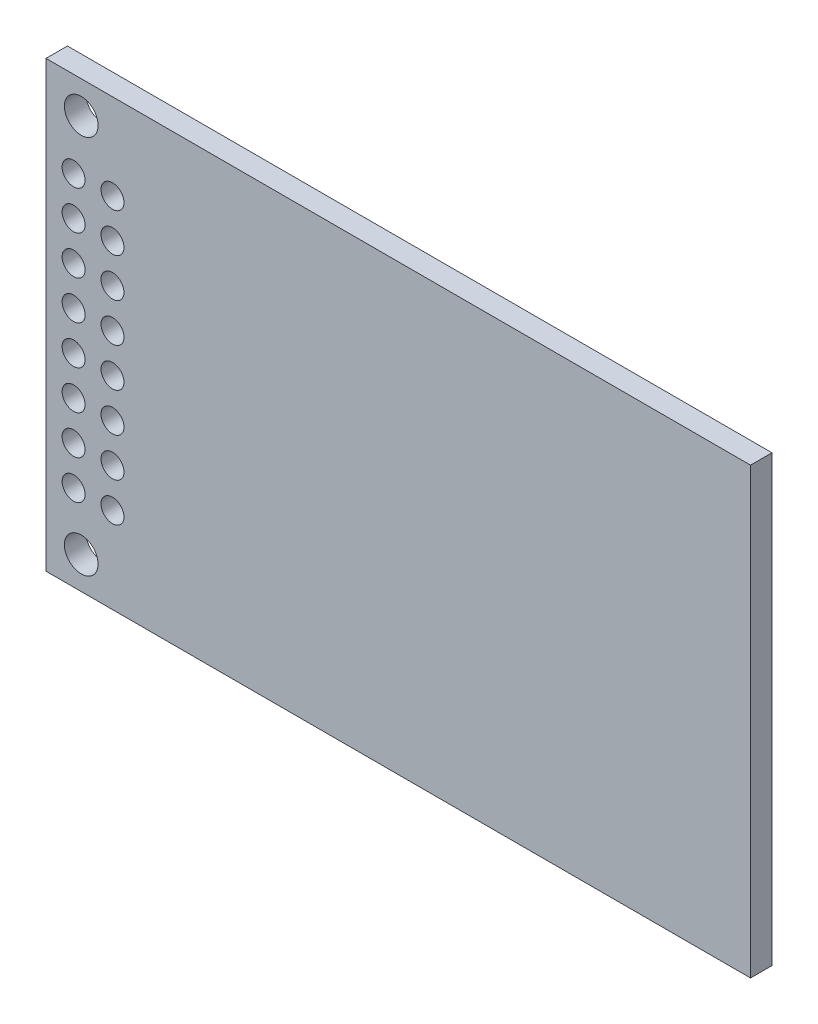
ISO-10303-21;
HEADER;
FILE_DESCRIPTION(('STEP AP214'),'2;1');
FILE_NAME('part.step','',(''),(''),'','','');
FILE_SCHEMA(('AUTOMOTIVE_DESIGN { 1 0 10303 214 1 1 1 1 }'));
ENDSEC;
DATA;
#1=APPLICATION_CONTEXT('core data for automotive mechanical design processes');
#2=APPLICATION_PROTOCOL_DEFINITION('international standard','automotive_design',2000,#1);
#3=PRODUCT_CONTEXT('',#1,'mechanical');
#4=PRODUCT('Part','Part','',(#3));
#5=PRODUCT_RELATED_PRODUCT_CATEGORY('part','',(#4));
#6=PRODUCT_DEFINITION_FORMATION('','',#4);
#7=PRODUCT_DEFINITION_CONTEXT('part definition',#1,'design');
#8=PRODUCT_DEFINITION('design','',#6,#7);
#9=PRODUCT_DEFINITION_SHAPE('','',#8);
#10=(LENGTH_UNIT() NAMED_UNIT(*) SI_UNIT(.MILLI.,.METRE.));
#11=(NAMED_UNIT(*) PLANE_ANGLE_UNIT() SI_UNIT($,.RADIAN.));
#12=(NAMED_UNIT(*) SI_UNIT($,.STERADIAN.) SOLID_ANGLE_UNIT());
#13=UNCERTAINTY_MEASURE_WITH_UNIT(LENGTH_MEASURE(1.E-05),#10,'distance_accuracy_value','');
#14=(GEOMETRIC_REPRESENTATION_CONTEXT(3) GLOBAL_UNCERTAINTY_ASSIGNED_CONTEXT((#13)) GLOBAL_UNIT_ASSIGNED_CONTEXT((#10,
#11,#12)) REPRESENTATION_CONTEXT('',''));
#15=CARTESIAN_POINT('',(0.,0.,0.));
#16=DIRECTION('',(0.,0.,1.));
#17=DIRECTION('',(1.,0.,0.));
#18=AXIS2_PLACEMENT_3D('',#15,#16,#17);
#19=CARTESIAN_POINT('',(0.,0.,0.));
#20=DIRECTION('',(0.,0.,-1.));
#21=DIRECTION('',(-1.,0.,0.));
#22=AXIS2_PLACEMENT_3D('',#19,#20,#21);
#23=PLANE('',#22);
#24=CARTESIAN_POINT('',(-20.7,12.4,0.));
#25=DIRECTION('',(0.,0.,1.));
#26=DIRECTION('',(1.,0.,0.));
#27=AXIS2_PLACEMENT_3D('',#24,#25,#26);
#28=CIRCLE('',#27,1.1);
#29=CARTESIAN_POINT('',(-19.6,12.4,0.));
#30=VERTEX_POINT('',#29);
#31=EDGE_CURVE('E131',#30,#30,#28,.T.);
#32=ORIENTED_EDGE('',*,*,#31,.T.);
#33=EDGE_LOOP('',(#32));
#34=FACE_BOUND('',#33,.T.);
#35=CARTESIAN_POINT('',(-20.7,-12.4,0.));
#36=DIRECTION('',(0.,0.,1.));
#37=DIRECTION('',(1.,0.,0.));
#38=AXIS2_PLACEMENT_3D('',#35,#36,#37);
#39=CIRCLE('',#38,1.1);
#40=CARTESIAN_POINT('',(-19.6,-12.4,0.));
#41=VERTEX_POINT('',#40);
#42=EDGE_CURVE('E134',#41,#41,#39,.T.);
#43=ORIENTED_EDGE('',*,*,#42,.T.);
#44=EDGE_LOOP('',(#43));
#45=FACE_BOUND('',#44,.T.);
#46=CARTESIAN_POINT('',(-21.2,8.89,0.));
#47=DIRECTION('',(0.,0.,1.));
#48=DIRECTION('',(1.,0.,0.));
#49=AXIS2_PLACEMENT_3D('',#46,#47,#48);
#50=CIRCLE('',#49,0.750000000000001);
#51=CARTESIAN_POINT('',(-20.45,8.89,0.));
#52=VERTEX_POINT('',#51);
#53=EDGE_CURVE('E137',#52,#52,#50,.T.);
#54=ORIENTED_EDGE('',*,*,#53,.T.);
#55=EDGE_LOOP('',(#54));
#56=FACE_BOUND('',#55,.T.);
#57=CARTESIAN_POINT('',(-18.66,8.89,0.));
#58=DIRECTION('',(0.,0.,1.));
#59=DIRECTION('',(1.,0.,0.));
#60=AXIS2_PLACEMENT_3D('',#57,#58,#59);
#61=CIRCLE('',#60,0.750000000000001);
#62=CARTESIAN_POINT('',(-17.91,8.89,0.));
#63=VERTEX_POINT('',#62);
#64=EDGE_CURVE('E140',#63,#63,#61,.T.);
#65=ORIENTED_EDGE('',*,*,#64,.T.);
#66=EDGE_LOOP('',(#65));
#67=FACE_BOUND('',#66,.T.);
#68=CARTESIAN_POINT('',(-18.66,6.35,0.));
#69=DIRECTION('',(0.,0.,1.));
#70=DIRECTION('',(1.,0.,0.));
#71=AXIS2_PLACEMENT_3D('',#68,#69,#70);
#72=CIRCLE('',#71,0.750000000000001);
#73=CARTESIAN_POINT('',(-17.91,6.35,0.));
#74=VERTEX_POINT('',#73);
#75=EDGE_CURVE('E143',#74,#74,#72,.T.);
#76=ORIENTED_EDGE('',*,*,#75,.T.);
#77=EDGE_LOOP('',(#76));
#78=FACE_BOUND('',#77,.T.);
#79=CARTESIAN_POINT('',(-18.66,3.81,0.));
#80=DIRECTION('',(0.,0.,1.));
#81=DIRECTION('',(1.,0.,0.));
#82=AXIS2_PLACEMENT_3D('',#79,#80,#81);
#83=CIRCLE('',#82,0.750000000000001);
#84=CARTESIAN_POINT('',(-17.91,3.81,0.));
#85=VERTEX_POINT('',#84);
#86=EDGE_CURVE('E146',#85,#85,#83,.T.);
#87=ORIENTED_EDGE('',*,*,#86,.T.);
#88=EDGE_LOOP('',(#87));
#89=FACE_BOUND('',#88,.T.);
#90=CARTESIAN_POINT('',(-18.66,1.27,0.));
#91=DIRECTION('',(0.,0.,1.));
#92=DIRECTION('',(1.,0.,0.));
#93=AXIS2_PLACEMENT_3D('',#90,#91,#92);
#94=CIRCLE('',#93,0.750000000000004);
#95=CARTESIAN_POINT('',(-17.91,1.27,0.));
#96=VERTEX_POINT('',#95);
#97=EDGE_CURVE('E149',#96,#96,#94,.T.);
#98=ORIENTED_EDGE('',*,*,#97,.T.);
#99=EDGE_LOOP('',(#98));
#100=FACE_BOUND('',#99,.T.);
#101=CARTESIAN_POINT('',(-18.66,-1.27,0.));
#102=DIRECTION('',(0.,0.,1.));
#103=DIRECTION('',(1.,0.,0.));
#104=AXIS2_PLACEMENT_3D('',#101,#102,#103);
#105=CIRCLE('',#104,0.750000000000001);
#106=CARTESIAN_POINT('',(-17.91,-1.27,0.));
#107=VERTEX_POINT('',#106);
#108=EDGE_CURVE('E152',#107,#107,#105,.T.);
#109=ORIENTED_EDGE('',*,*,#108,.T.);
#110=EDGE_LOOP('',(#109));
#111=FACE_BOUND('',#110,.T.);
#112=CARTESIAN_POINT('',(-18.66,-3.81,0.));
#113=DIRECTION('',(0.,0.,1.));
#114=DIRECTION('',(1.,0.,0.));
#115=AXIS2_PLACEMENT_3D('',#112,#113,#114);
#116=CIRCLE('',#115,0.750000000000001);
#117=CARTESIAN_POINT('',(-17.91,-3.81,0.));
#118=VERTEX_POINT('',#117);
#119=EDGE_CURVE('E155',#118,#118,#116,.T.);
#120=ORIENTED_EDGE('',*,*,#119,.T.);
#121=EDGE_LOOP('',(#120));
#122=FACE_BOUND('',#121,.T.);
#123=CARTESIAN_POINT('',(-18.66,-6.35,0.));
#124=DIRECTION('',(0.,0.,1.));
#125=DIRECTION('',(1.,0.,0.));
#126=AXIS2_PLACEMENT_3D('',#123,#124,#125);
#127=CIRCLE('',#126,0.750000000000001);
#128=CARTESIAN_POINT('',(-17.91,-6.35,0.));
#129=VERTEX_POINT('',#128);
#130=EDGE_CURVE('E158',#129,#129,#127,.T.);
#131=ORIENTED_EDGE('',*,*,#130,.T.);
#132=EDGE_LOOP('',(#131));
#133=FACE_BOUND('',#132,.T.);
#134=CARTESIAN_POINT('',(-18.66,-8.89,0.));
#135=DIRECTION('',(0.,0.,1.));
#136=DIRECTION('',(1.,0.,0.));
#137=AXIS2_PLACEMENT_3D('',#134,#135,#136);
#138=CIRCLE('',#137,0.750000000000001);
#139=CARTESIAN_POINT('',(-17.91,-8.89,0.));
#140=VERTEX_POINT('',#139);
#141=EDGE_CURVE('E161',#140,#140,#138,.T.);
#142=ORIENTED_EDGE('',*,*,#141,.T.);
#143=EDGE_LOOP('',(#142));
#144=FACE_BOUND('',#143,.T.);
#145=CARTESIAN_POINT('',(-21.2,6.35,0.));
#146=DIRECTION('',(0.,0.,1.));
#147=DIRECTION('',(1.,0.,0.));
#148=AXIS2_PLACEMENT_3D('',#145,#146,#147);
#149=CIRCLE('',#148,0.750000000000001);
#150=CARTESIAN_POINT('',(-20.45,6.35,0.));
#151=VERTEX_POINT('',#150);
#152=EDGE_CURVE('E164',#151,#151,#149,.T.);
#153=ORIENTED_EDGE('',*,*,#152,.T.);
#154=EDGE_LOOP('',(#153));
#155=FACE_BOUND('',#154,.T.);
#156=CARTESIAN_POINT('',(-21.2,3.81,0.));
#157=DIRECTION('',(0.,0.,1.));
#158=DIRECTION('',(1.,0.,0.));
#159=AXIS2_PLACEMENT_3D('',#156,#157,#158);
#160=CIRCLE('',#159,0.750000000000001);
#161=CARTESIAN_POINT('',(-20.45,3.81,0.));
#162=VERTEX_POINT('',#161);
#163=EDGE_CURVE('E167',#162,#162,#160,.T.);
#164=ORIENTED_EDGE('',*,*,#163,.T.);
#165=EDGE_LOOP('',(#164));
#166=FACE_BOUND('',#165,.T.);
#167=CARTESIAN_POINT('',(-21.2,1.27,0.));
#168=DIRECTION('',(0.,0.,1.));
#169=DIRECTION('',(1.,0.,0.));
#170=AXIS2_PLACEMENT_3D('',#167,#168,#169);
#171=CIRCLE('',#170,0.750000000000001);
#172=CARTESIAN_POINT('',(-20.45,1.27,0.));
#173=VERTEX_POINT('',#172);
#174=EDGE_CURVE('E170',#173,#173,#171,.T.);
#175=ORIENTED_EDGE('',*,*,#174,.T.);
#176=EDGE_LOOP('',(#175));
#177=FACE_BOUND('',#176,.T.);
#178=CARTESIAN_POINT('',(-21.2,-1.27,0.));
#179=DIRECTION('',(0.,0.,1.));
#180=DIRECTION('',(1.,0.,0.));
#181=AXIS2_PLACEMENT_3D('',#178,#179,#180);
#182=CIRCLE('',#181,0.750000000000001);
#183=CARTESIAN_POINT('',(-20.45,-1.27,0.));
#184=VERTEX_POINT('',#183);
#185=EDGE_CURVE('E173',#184,#184,#182,.T.);
#186=ORIENTED_EDGE('',*,*,#185,.T.);
#187=EDGE_LOOP('',(#186));
#188=FACE_BOUND('',#187,.T.);
#189=CARTESIAN_POINT('',(-21.2,-3.81,0.));
#190=DIRECTION('',(0.,0.,1.));
#191=DIRECTION('',(1.,0.,0.));
#192=AXIS2_PLACEMENT_3D('',#189,#190,#191);
#193=CIRCLE('',#192,0.750000000000001);
#194=CARTESIAN_POINT('',(-20.45,-3.81,0.));
#195=VERTEX_POINT('',#194);
#196=EDGE_CURVE('E176',#195,#195,#193,.T.);
#197=ORIENTED_EDGE('',*,*,#196,.T.);
#198=EDGE_LOOP('',(#197));
#199=FACE_BOUND('',#198,.T.);
#200=CARTESIAN_POINT('',(-21.2,-6.35,0.));
#201=DIRECTION('',(0.,0.,1.));
#202=DIRECTION('',(1.,0.,0.));
#203=AXIS2_PLACEMENT_3D('',#200,#201,#202);
#204=CIRCLE('',#203,0.750000000000001);
#205=CARTESIAN_POINT('',(-20.45,-6.35,0.));
#206=VERTEX_POINT('',#205);
#207=EDGE_CURVE('E178',#206,#206,#204,.T.);
#208=ORIENTED_EDGE('',*,*,#207,.T.);
#209=EDGE_LOOP('',(#208));
#210=FACE_BOUND('',#209,.T.);
#211=CARTESIAN_POINT('',(-21.2,-8.89,0.));
#212=DIRECTION('',(0.,0.,1.));
#213=DIRECTION('',(1.,0.,0.));
#214=AXIS2_PLACEMENT_3D('',#211,#212,#213);
#215=CIRCLE('',#214,0.750000000000001);
#216=CARTESIAN_POINT('',(-20.45,-8.89,0.));
#217=VERTEX_POINT('',#216);
#218=EDGE_CURVE('E20',#217,#217,#215,.T.);
#219=ORIENTED_EDGE('',*,*,#218,.T.);
#220=EDGE_LOOP('',(#219));
#221=FACE_BOUND('',#220,.T.);
#222=DIRECTION('',(0.,1.,0.));
#223=VECTOR('',#222,1.);
#224=CARTESIAN_POINT('',(-23.,-14.5,0.));
#225=LINE('',#224,#223);
#226=CARTESIAN_POINT('',(-23.,-14.5,0.));
#227=VERTEX_POINT('',#226);
#228=CARTESIAN_POINT('',(-23.,14.5,0.));
#229=VERTEX_POINT('',#228);
#230=EDGE_CURVE('E56',#227,#229,#225,.T.);
#231=ORIENTED_EDGE('',*,*,#230,.T.);
#232=DIRECTION('',(1.,0.,0.));
#233=VECTOR('',#232,1.);
#234=CARTESIAN_POINT('',(-23.,14.5,0.));
#235=LINE('',#234,#233);
#236=CARTESIAN_POINT('',(23.,14.5,0.));
#237=VERTEX_POINT('',#236);
#238=EDGE_CURVE('E192',#229,#237,#235,.T.);
#239=ORIENTED_EDGE('',*,*,#238,.T.);
#240=DIRECTION('',(0.,1.,0.));
#241=VECTOR('',#240,1.);
#242=CARTESIAN_POINT('',(23.,-14.5,0.));
#243=LINE('',#242,#241);
#244=CARTESIAN_POINT('',(23.,-14.5,0.));
#245=VERTEX_POINT('',#244);
#246=EDGE_CURVE('E60',#237,#245,#243,.F.);
#247=ORIENTED_EDGE('',*,*,#246,.T.);
#248=DIRECTION('',(1.,0.,0.));
#249=VECTOR('',#248,1.);
#250=CARTESIAN_POINT('',(-23.,-14.5,0.));
#251=LINE('',#250,#249);
#252=EDGE_CURVE('E59',#245,#227,#251,.F.);
#253=ORIENTED_EDGE('',*,*,#252,.T.);
#254=EDGE_LOOP('',(#231,#239,#247,#253));
#255=FACE_BOUND('',#254,.T.);
#256=ADVANCED_FACE('F17',(#34,#45,#56,#67,#78,#89,#100,#111,#122,#133,#144,#155,#166,#177,#188,
#199,#210,#221,#255),#23,.T.);
#257=CARTESIAN_POINT('',(-23.,-14.5,1.4));
#258=DIRECTION('',(0.,1.,0.));
#259=DIRECTION('',(0.,0.,1.));
#260=AXIS2_PLACEMENT_3D('',#257,#258,#259);
#261=PLANE('',#260);
#262=DIRECTION('',(0.,0.,1.));
#263=VECTOR('',#262,1.);
#264=CARTESIAN_POINT('',(23.,-14.5,1.4));
#265=LINE('',#264,#263);
#266=CARTESIAN_POINT('',(23.,-14.5,1.4));
#267=VERTEX_POINT('',#266);
#268=EDGE_CURVE('E186',#245,#267,#265,.T.);
#269=ORIENTED_EDGE('',*,*,#268,.T.);
#270=DIRECTION('',(-1.,0.,0.));
#271=VECTOR('',#270,1.);
#272=CARTESIAN_POINT('',(0.,-14.5,1.4));
#273=LINE('',#272,#271);
#274=CARTESIAN_POINT('',(-23.,-14.5,1.4));
#275=VERTEX_POINT('',#274);
#276=EDGE_CURVE('E76',#267,#275,#273,.T.);
#277=ORIENTED_EDGE('',*,*,#276,.T.);
#278=DIRECTION('',(0.,0.,-1.));
#279=VECTOR('',#278,1.);
#280=CARTESIAN_POINT('',(-23.,-14.5,1.4));
#281=LINE('',#280,#279);
#282=EDGE_CURVE('E65',#275,#227,#281,.T.);
#283=ORIENTED_EDGE('',*,*,#282,.T.);
#284=ORIENTED_EDGE('',*,*,#252,.F.);
#285=EDGE_LOOP('',(#269,#277,#283,#284));
#286=FACE_BOUND('',#285,.T.);
#287=ADVANCED_FACE('F75',(#286),#261,.F.);
#288=CARTESIAN_POINT('',(-23.,-14.5,1.4));
#289=DIRECTION('',(1.,0.,0.));
#290=DIRECTION('',(0.,0.,-1.));
#291=AXIS2_PLACEMENT_3D('',#288,#289,#290);
#292=PLANE('',#291);
#293=ORIENTED_EDGE('',*,*,#282,.F.);
#294=DIRECTION('',(0.,1.,0.));
#295=VECTOR('',#294,1.);
#296=CARTESIAN_POINT('',(-23.,0.,1.4));
#297=LINE('',#296,#295);
#298=CARTESIAN_POINT('',(-23.,14.5,1.4));
#299=VERTEX_POINT('',#298);
#300=EDGE_CURVE('E200',#275,#299,#297,.T.);
#301=ORIENTED_EDGE('',*,*,#300,.T.);
#302=DIRECTION('',(0.,0.,-1.));
#303=VECTOR('',#302,1.);
#304=CARTESIAN_POINT('',(-23.,14.5,1.4));
#305=LINE('',#304,#303);
#306=EDGE_CURVE('E72',#299,#229,#305,.T.);
#307=ORIENTED_EDGE('',*,*,#306,.T.);
#308=ORIENTED_EDGE('',*,*,#230,.F.);
#309=EDGE_LOOP('',(#293,#301,#307,#308));
#310=FACE_BOUND('',#309,.T.);
#311=ADVANCED_FACE('F69',(#310),#292,.F.);
#312=CARTESIAN_POINT('',(-23.,14.5,1.4));
#313=DIRECTION('',(0.,-1.,0.));
#314=DIRECTION('',(0.,0.,-1.));
#315=AXIS2_PLACEMENT_3D('',#312,#313,#314);
#316=PLANE('',#315);
#317=ORIENTED_EDGE('',*,*,#306,.F.);
#318=DIRECTION('',(-1.,0.,0.));
#319=VECTOR('',#318,1.);
#320=CARTESIAN_POINT('',(0.,14.5,1.4));
#321=LINE('',#320,#319);
#322=CARTESIAN_POINT('',(23.,14.5,1.4));
#323=VERTEX_POINT('',#322);
#324=EDGE_CURVE('E198',#299,#323,#321,.F.);
#325=ORIENTED_EDGE('',*,*,#324,.T.);
#326=DIRECTION('',(0.,0.,1.));
#327=VECTOR('',#326,1.);
#328=CARTESIAN_POINT('',(23.,14.5,1.4));
#329=LINE('',#328,#327);
#330=EDGE_CURVE('E35',#323,#237,#329,.F.);
#331=ORIENTED_EDGE('',*,*,#330,.T.);
#332=ORIENTED_EDGE('',*,*,#238,.F.);
#333=EDGE_LOOP('',(#317,#325,#331,#332));
#334=FACE_BOUND('',#333,.T.);
#335=ADVANCED_FACE('F196',(#334),#316,.F.);
#336=CARTESIAN_POINT('',(23.,-14.5,1.4));
#337=DIRECTION('',(-1.,0.,0.));
#338=DIRECTION('',(0.,0.,1.));
#339=AXIS2_PLACEMENT_3D('',#336,#337,#338);
#340=PLANE('',#339);
#341=ORIENTED_EDGE('',*,*,#330,.F.);
#342=DIRECTION('',(0.,1.,0.));
#343=VECTOR('',#342,1.);
#344=CARTESIAN_POINT('',(23.,0.,1.4));
#345=LINE('',#344,#343);
#346=EDGE_CURVE('E130',#323,#267,#345,.F.);
#347=ORIENTED_EDGE('',*,*,#346,.T.);
#348=ORIENTED_EDGE('',*,*,#268,.F.);
#349=ORIENTED_EDGE('',*,*,#246,.F.);
#350=EDGE_LOOP('',(#341,#347,#348,#349));
#351=FACE_BOUND('',#350,.T.);
#352=ADVANCED_FACE('F194',(#351),#340,.F.);
#353=CARTESIAN_POINT('',(-21.2,-8.89,0.));
#354=DIRECTION('',(0.,0.,1.));
#355=DIRECTION('',(1.,0.,0.));
#356=AXIS2_PLACEMENT_3D('',#353,#354,#355);
#357=CYLINDRICAL_SURFACE('',#356,0.750000000000001);
#358=CARTESIAN_POINT('',(-21.2,-8.89,1.4));
#359=DIRECTION('',(0.,0.,1.));
#360=DIRECTION('',(1.,0.,0.));
#361=AXIS2_PLACEMENT_3D('',#358,#359,#360);
#362=CIRCLE('',#361,0.750000000000001);
#363=CARTESIAN_POINT('',(-20.45,-8.89,1.4));
#364=VERTEX_POINT('',#363);
#365=EDGE_CURVE('E127',#364,#364,#362,.T.);
#366=ORIENTED_EDGE('',*,*,#365,.T.);
#367=EDGE_LOOP('',(#366));
#368=FACE_BOUND('',#367,.T.);
#369=ORIENTED_EDGE('',*,*,#218,.F.);
#370=EDGE_LOOP('',(#369));
#371=FACE_BOUND('',#370,.T.);
#372=ADVANCED_FACE('F280',(#368,#371),#357,.F.);
#373=CARTESIAN_POINT('',(-21.2,-6.35,0.));
#374=DIRECTION('',(0.,0.,1.));
#375=DIRECTION('',(1.,0.,0.));
#376=AXIS2_PLACEMENT_3D('',#373,#374,#375);
#377=CYLINDRICAL_SURFACE('',#376,0.750000000000001);
#378=CARTESIAN_POINT('',(-21.2,-6.35,1.4));
#379=DIRECTION('',(0.,0.,1.));
#380=DIRECTION('',(1.,0.,0.));
#381=AXIS2_PLACEMENT_3D('',#378,#379,#380);
#382=CIRCLE('',#381,0.750000000000001);
#383=CARTESIAN_POINT('',(-20.45,-6.35,1.4));
#384=VERTEX_POINT('',#383);
#385=EDGE_CURVE('E124',#384,#384,#382,.T.);
#386=ORIENTED_EDGE('',*,*,#385,.T.);
#387=EDGE_LOOP('',(#386));
#388=FACE_BOUND('',#387,.T.);
#389=ORIENTED_EDGE('',*,*,#207,.F.);
#390=EDGE_LOOP('',(#389));
#391=FACE_BOUND('',#390,.T.);
#392=ADVANCED_FACE('F276',(#388,#391),#377,.F.);
#393=CARTESIAN_POINT('',(-21.2,-3.81,0.));
#394=DIRECTION('',(0.,0.,1.));
#395=DIRECTION('',(1.,0.,0.));
#396=AXIS2_PLACEMENT_3D('',#393,#394,#395);
#397=CYLINDRICAL_SURFACE('',#396,0.750000000000001);
#398=CARTESIAN_POINT('',(-21.2,-3.81,1.4));
#399=DIRECTION('',(0.,0.,1.));
#400=DIRECTION('',(1.,0.,0.));
#401=AXIS2_PLACEMENT_3D('',#398,#399,#400);
#402=CIRCLE('',#401,0.750000000000001);
#403=CARTESIAN_POINT('',(-20.45,-3.81,1.4));
#404=VERTEX_POINT('',#403);
#405=EDGE_CURVE('E121',#404,#404,#402,.T.);
#406=ORIENTED_EDGE('',*,*,#405,.T.);
#407=EDGE_LOOP('',(#406));
#408=FACE_BOUND('',#407,.T.);
#409=ORIENTED_EDGE('',*,*,#196,.F.);
#410=EDGE_LOOP('',(#409));
#411=FACE_BOUND('',#410,.T.);
#412=ADVANCED_FACE('F272',(#408,#411),#397,.F.);
#413=CARTESIAN_POINT('',(-21.2,-1.27,0.));
#414=DIRECTION('',(0.,0.,1.));
#415=DIRECTION('',(1.,0.,0.));
#416=AXIS2_PLACEMENT_3D('',#413,#414,#415);
#417=CYLINDRICAL_SURFACE('',#416,0.750000000000001);
#418=CARTESIAN_POINT('',(-21.2,-1.27,1.4));
#419=DIRECTION('',(0.,0.,1.));
#420=DIRECTION('',(1.,0.,0.));
#421=AXIS2_PLACEMENT_3D('',#418,#419,#420);
#422=CIRCLE('',#421,0.750000000000001);
#423=CARTESIAN_POINT('',(-20.45,-1.27,1.4));
#424=VERTEX_POINT('',#423);
#425=EDGE_CURVE('E118',#424,#424,#422,.T.);
#426=ORIENTED_EDGE('',*,*,#425,.T.);
#427=EDGE_LOOP('',(#426));
#428=FACE_BOUND('',#427,.T.);
#429=ORIENTED_EDGE('',*,*,#185,.F.);
#430=EDGE_LOOP('',(#429));
#431=FACE_BOUND('',#430,.T.);
#432=ADVANCED_FACE('F268',(#428,#431),#417,.F.);
#433=CARTESIAN_POINT('',(-21.2,1.27,0.));
#434=DIRECTION('',(0.,0.,1.));
#435=DIRECTION('',(1.,0.,0.));
#436=AXIS2_PLACEMENT_3D('',#433,#434,#435);
#437=CYLINDRICAL_SURFACE('',#436,0.750000000000001);
#438=CARTESIAN_POINT('',(-21.2,1.27,1.4));
#439=DIRECTION('',(0.,0.,1.));
#440=DIRECTION('',(1.,0.,0.));
#441=AXIS2_PLACEMENT_3D('',#438,#439,#440);
#442=CIRCLE('',#441,0.750000000000001);
#443=CARTESIAN_POINT('',(-20.45,1.27,1.4));
#444=VERTEX_POINT('',#443);
#445=EDGE_CURVE('E115',#444,#444,#442,.T.);
#446=ORIENTED_EDGE('',*,*,#445,.T.);
#447=EDGE_LOOP('',(#446));
#448=FACE_BOUND('',#447,.T.);
#449=ORIENTED_EDGE('',*,*,#174,.F.);
#450=EDGE_LOOP('',(#449));
#451=FACE_BOUND('',#450,.T.);
#452=ADVANCED_FACE('F264',(#448,#451),#437,.F.);
#453=CARTESIAN_POINT('',(-21.2,3.81,0.));
#454=DIRECTION('',(0.,0.,1.));
#455=DIRECTION('',(1.,0.,0.));
#456=AXIS2_PLACEMENT_3D('',#453,#454,#455);
#457=CYLINDRICAL_SURFACE('',#456,0.750000000000001);
#458=CARTESIAN_POINT('',(-21.2,3.81,1.4));
#459=DIRECTION('',(0.,0.,1.));
#460=DIRECTION('',(1.,0.,0.));
#461=AXIS2_PLACEMENT_3D('',#458,#459,#460);
#462=CIRCLE('',#461,0.750000000000001);
#463=CARTESIAN_POINT('',(-20.45,3.81,1.4));
#464=VERTEX_POINT('',#463);
#465=EDGE_CURVE('E112',#464,#464,#462,.T.);
#466=ORIENTED_EDGE('',*,*,#465,.T.);
#467=EDGE_LOOP('',(#466));
#468=FACE_BOUND('',#467,.T.);
#469=ORIENTED_EDGE('',*,*,#163,.F.);
#470=EDGE_LOOP('',(#469));
#471=FACE_BOUND('',#470,.T.);
#472=ADVANCED_FACE('F260',(#468,#471),#457,.F.);
#473=CARTESIAN_POINT('',(-21.2,6.35,0.));
#474=DIRECTION('',(0.,0.,1.));
#475=DIRECTION('',(1.,0.,0.));
#476=AXIS2_PLACEMENT_3D('',#473,#474,#475);
#477=CYLINDRICAL_SURFACE('',#476,0.750000000000001);
#478=CARTESIAN_POINT('',(-21.2,6.35,1.4));
#479=DIRECTION('',(0.,0.,1.));
#480=DIRECTION('',(1.,0.,0.));
#481=AXIS2_PLACEMENT_3D('',#478,#479,#480);
#482=CIRCLE('',#481,0.750000000000001);
#483=CARTESIAN_POINT('',(-20.45,6.35,1.4));
#484=VERTEX_POINT('',#483);
#485=EDGE_CURVE('E109',#484,#484,#482,.T.);
#486=ORIENTED_EDGE('',*,*,#485,.T.);
#487=EDGE_LOOP('',(#486));
#488=FACE_BOUND('',#487,.T.);
#489=ORIENTED_EDGE('',*,*,#152,.F.);
#490=EDGE_LOOP('',(#489));
#491=FACE_BOUND('',#490,.T.);
#492=ADVANCED_FACE('F256',(#488,#491),#477,.F.);
#493=CARTESIAN_POINT('',(-18.66,-8.89,0.));
#494=DIRECTION('',(0.,0.,1.));
#495=DIRECTION('',(1.,0.,0.));
#496=AXIS2_PLACEMENT_3D('',#493,#494,#495);
#497=CYLINDRICAL_SURFACE('',#496,0.750000000000001);
#498=CARTESIAN_POINT('',(-18.66,-8.89,1.4));
#499=DIRECTION('',(0.,0.,1.));
#500=DIRECTION('',(1.,0.,0.));
#501=AXIS2_PLACEMENT_3D('',#498,#499,#500);
#502=CIRCLE('',#501,0.750000000000001);
#503=CARTESIAN_POINT('',(-17.91,-8.89,1.4));
#504=VERTEX_POINT('',#503);
#505=EDGE_CURVE('E106',#504,#504,#502,.T.);
#506=ORIENTED_EDGE('',*,*,#505,.T.);
#507=EDGE_LOOP('',(#506));
#508=FACE_BOUND('',#507,.T.);
#509=ORIENTED_EDGE('',*,*,#141,.F.);
#510=EDGE_LOOP('',(#509));
#511=FACE_BOUND('',#510,.T.);
#512=ADVANCED_FACE('F252',(#508,#511),#497,.F.);
#513=CARTESIAN_POINT('',(-18.66,-6.35,0.));
#514=DIRECTION('',(0.,0.,1.));
#515=DIRECTION('',(1.,0.,0.));
#516=AXIS2_PLACEMENT_3D('',#513,#514,#515);
#517=CYLINDRICAL_SURFACE('',#516,0.750000000000001);
#518=CARTESIAN_POINT('',(-18.66,-6.35,1.4));
#519=DIRECTION('',(0.,0.,1.));
#520=DIRECTION('',(1.,0.,0.));
#521=AXIS2_PLACEMENT_3D('',#518,#519,#520);
#522=CIRCLE('',#521,0.750000000000001);
#523=CARTESIAN_POINT('',(-17.91,-6.35,1.4));
#524=VERTEX_POINT('',#523);
#525=EDGE_CURVE('E103',#524,#524,#522,.T.);
#526=ORIENTED_EDGE('',*,*,#525,.T.);
#527=EDGE_LOOP('',(#526));
#528=FACE_BOUND('',#527,.T.);
#529=ORIENTED_EDGE('',*,*,#130,.F.);
#530=EDGE_LOOP('',(#529));
#531=FACE_BOUND('',#530,.T.);
#532=ADVANCED_FACE('F248',(#528,#531),#517,.F.);
#533=CARTESIAN_POINT('',(-18.66,-3.81,0.));
#534=DIRECTION('',(0.,0.,1.));
#535=DIRECTION('',(1.,0.,0.));
#536=AXIS2_PLACEMENT_3D('',#533,#534,#535);
#537=CYLINDRICAL_SURFACE('',#536,0.750000000000001);
#538=CARTESIAN_POINT('',(-18.66,-3.81,1.4));
#539=DIRECTION('',(0.,0.,1.));
#540=DIRECTION('',(1.,0.,0.));
#541=AXIS2_PLACEMENT_3D('',#538,#539,#540);
#542=CIRCLE('',#541,0.750000000000001);
#543=CARTESIAN_POINT('',(-17.91,-3.81,1.4));
#544=VERTEX_POINT('',#543);
#545=EDGE_CURVE('E100',#544,#544,#542,.T.);
#546=ORIENTED_EDGE('',*,*,#545,.T.);
#547=EDGE_LOOP('',(#546));
#548=FACE_BOUND('',#547,.T.);
#549=ORIENTED_EDGE('',*,*,#119,.F.);
#550=EDGE_LOOP('',(#549));
#551=FACE_BOUND('',#550,.T.);
#552=ADVANCED_FACE('F244',(#548,#551),#537,.F.);
#553=CARTESIAN_POINT('',(-18.66,-1.27,0.));
#554=DIRECTION('',(0.,0.,1.));
#555=DIRECTION('',(1.,0.,0.));
#556=AXIS2_PLACEMENT_3D('',#553,#554,#555);
#557=CYLINDRICAL_SURFACE('',#556,0.750000000000001);
#558=CARTESIAN_POINT('',(-18.66,-1.27,1.4));
#559=DIRECTION('',(0.,0.,1.));
#560=DIRECTION('',(1.,0.,0.));
#561=AXIS2_PLACEMENT_3D('',#558,#559,#560);
#562=CIRCLE('',#561,0.750000000000001);
#563=CARTESIAN_POINT('',(-17.91,-1.27,1.4));
#564=VERTEX_POINT('',#563);
#565=EDGE_CURVE('E97',#564,#564,#562,.T.);
#566=ORIENTED_EDGE('',*,*,#565,.T.);
#567=EDGE_LOOP('',(#566));
#568=FACE_BOUND('',#567,.T.);
#569=ORIENTED_EDGE('',*,*,#108,.F.);
#570=EDGE_LOOP('',(#569));
#571=FACE_BOUND('',#570,.T.);
#572=ADVANCED_FACE('F240',(#568,#571),#557,.F.);
#573=CARTESIAN_POINT('',(-18.66,1.27,0.));
#574=DIRECTION('',(0.,0.,1.));
#575=DIRECTION('',(1.,0.,0.));
#576=AXIS2_PLACEMENT_3D('',#573,#574,#575);
#577=CYLINDRICAL_SURFACE('',#576,0.750000000000004);
#578=CARTESIAN_POINT('',(-18.66,1.27,1.4));
#579=DIRECTION('',(0.,0.,1.));
#580=DIRECTION('',(1.,0.,0.));
#581=AXIS2_PLACEMENT_3D('',#578,#579,#580);
#582=CIRCLE('',#581,0.750000000000004);
#583=CARTESIAN_POINT('',(-17.91,1.27,1.4));
#584=VERTEX_POINT('',#583);
#585=EDGE_CURVE('E94',#584,#584,#582,.T.);
#586=ORIENTED_EDGE('',*,*,#585,.T.);
#587=EDGE_LOOP('',(#586));
#588=FACE_BOUND('',#587,.T.);
#589=ORIENTED_EDGE('',*,*,#97,.F.);
#590=EDGE_LOOP('',(#589));
#591=FACE_BOUND('',#590,.T.);
#592=ADVANCED_FACE('F236',(#588,#591),#577,.F.);
#593=CARTESIAN_POINT('',(-18.66,3.81,0.));
#594=DIRECTION('',(0.,0.,1.));
#595=DIRECTION('',(1.,0.,0.));
#596=AXIS2_PLACEMENT_3D('',#593,#594,#595);
#597=CYLINDRICAL_SURFACE('',#596,0.750000000000001);
#598=CARTESIAN_POINT('',(-18.66,3.81,1.4));
#599=DIRECTION('',(0.,0.,1.));
#600=DIRECTION('',(1.,0.,0.));
#601=AXIS2_PLACEMENT_3D('',#598,#599,#600);
#602=CIRCLE('',#601,0.750000000000001);
#603=CARTESIAN_POINT('',(-17.91,3.81,1.4));
#604=VERTEX_POINT('',#603);
#605=EDGE_CURVE('E91',#604,#604,#602,.T.);
#606=ORIENTED_EDGE('',*,*,#605,.T.);
#607=EDGE_LOOP('',(#606));
#608=FACE_BOUND('',#607,.T.);
#609=ORIENTED_EDGE('',*,*,#86,.F.);
#610=EDGE_LOOP('',(#609));
#611=FACE_BOUND('',#610,.T.);
#612=ADVANCED_FACE('F232',(#608,#611),#597,.F.);
#613=CARTESIAN_POINT('',(-18.66,6.35,0.));
#614=DIRECTION('',(0.,0.,1.));
#615=DIRECTION('',(1.,0.,0.));
#616=AXIS2_PLACEMENT_3D('',#613,#614,#615);
#617=CYLINDRICAL_SURFACE('',#616,0.750000000000001);
#618=CARTESIAN_POINT('',(-18.66,6.35,1.4));
#619=DIRECTION('',(0.,0.,1.));
#620=DIRECTION('',(1.,0.,0.));
#621=AXIS2_PLACEMENT_3D('',#618,#619,#620);
#622=CIRCLE('',#621,0.750000000000001);
#623=CARTESIAN_POINT('',(-17.91,6.35,1.4));
#624=VERTEX_POINT('',#623);
#625=EDGE_CURVE('E88',#624,#624,#622,.T.);
#626=ORIENTED_EDGE('',*,*,#625,.T.);
#627=EDGE_LOOP('',(#626));
#628=FACE_BOUND('',#627,.T.);
#629=ORIENTED_EDGE('',*,*,#75,.F.);
#630=EDGE_LOOP('',(#629));
#631=FACE_BOUND('',#630,.T.);
#632=ADVANCED_FACE('F228',(#628,#631),#617,.F.);
#633=CARTESIAN_POINT('',(-18.66,8.89,0.));
#634=DIRECTION('',(0.,0.,1.));
#635=DIRECTION('',(1.,0.,0.));
#636=AXIS2_PLACEMENT_3D('',#633,#634,#635);
#637=CYLINDRICAL_SURFACE('',#636,0.750000000000001);
#638=CARTESIAN_POINT('',(-18.66,8.89,1.4));
#639=DIRECTION('',(0.,0.,1.));
#640=DIRECTION('',(1.,0.,0.));
#641=AXIS2_PLACEMENT_3D('',#638,#639,#640);
#642=CIRCLE('',#641,0.750000000000001);
#643=CARTESIAN_POINT('',(-17.91,8.89,1.4));
#644=VERTEX_POINT('',#643);
#645=EDGE_CURVE('E85',#644,#644,#642,.T.);
#646=ORIENTED_EDGE('',*,*,#645,.T.);
#647=EDGE_LOOP('',(#646));
#648=FACE_BOUND('',#647,.T.);
#649=ORIENTED_EDGE('',*,*,#64,.F.);
#650=EDGE_LOOP('',(#649));
#651=FACE_BOUND('',#650,.T.);
#652=ADVANCED_FACE('F224',(#648,#651),#637,.F.);
#653=CARTESIAN_POINT('',(-21.2,8.89,0.));
#654=DIRECTION('',(0.,0.,1.));
#655=DIRECTION('',(1.,0.,0.));
#656=AXIS2_PLACEMENT_3D('',#653,#654,#655);
#657=CYLINDRICAL_SURFACE('',#656,0.750000000000001);
#658=CARTESIAN_POINT('',(-21.2,8.89,1.4));
#659=DIRECTION('',(0.,0.,1.));
#660=DIRECTION('',(1.,0.,0.));
#661=AXIS2_PLACEMENT_3D('',#658,#659,#660);
#662=CIRCLE('',#661,0.750000000000001);
#663=CARTESIAN_POINT('',(-20.45,8.89,1.4));
#664=VERTEX_POINT('',#663);
#665=EDGE_CURVE('E82',#664,#664,#662,.T.);
#666=ORIENTED_EDGE('',*,*,#665,.T.);
#667=EDGE_LOOP('',(#666));
#668=FACE_BOUND('',#667,.T.);
#669=ORIENTED_EDGE('',*,*,#53,.F.);
#670=EDGE_LOOP('',(#669));
#671=FACE_BOUND('',#670,.T.);
#672=ADVANCED_FACE('F220',(#668,#671),#657,.F.);
#673=CARTESIAN_POINT('',(-20.7,-12.4,0.));
#674=DIRECTION('',(0.,0.,1.));
#675=DIRECTION('',(1.,0.,0.));
#676=AXIS2_PLACEMENT_3D('',#673,#674,#675);
#677=CYLINDRICAL_SURFACE('',#676,1.1);
#678=CARTESIAN_POINT('',(-20.7,-12.4,1.4));
#679=DIRECTION('',(0.,0.,1.));
#680=DIRECTION('',(1.,0.,0.));
#681=AXIS2_PLACEMENT_3D('',#678,#679,#680);
#682=CIRCLE('',#681,1.1);
#683=CARTESIAN_POINT('',(-19.6,-12.4,1.4));
#684=VERTEX_POINT('',#683);
#685=EDGE_CURVE('E26',#684,#684,#682,.T.);
#686=ORIENTED_EDGE('',*,*,#685,.T.);
#687=EDGE_LOOP('',(#686));
#688=FACE_BOUND('',#687,.T.);
#689=ORIENTED_EDGE('',*,*,#42,.F.);
#690=EDGE_LOOP('',(#689));
#691=FACE_BOUND('',#690,.T.);
#692=ADVANCED_FACE('F212',(#688,#691),#677,.F.);
#693=CARTESIAN_POINT('',(-20.7,12.4,0.));
#694=DIRECTION('',(0.,0.,1.));
#695=DIRECTION('',(1.,0.,0.));
#696=AXIS2_PLACEMENT_3D('',#693,#694,#695);
#697=CYLINDRICAL_SURFACE('',#696,1.1);
#698=CARTESIAN_POINT('',(-20.7,12.4,1.4));
#699=DIRECTION('',(0.,0.,1.));
#700=DIRECTION('',(1.,0.,0.));
#701=AXIS2_PLACEMENT_3D('',#698,#699,#700);
#702=CIRCLE('',#701,1.1);
#703=CARTESIAN_POINT('',(-19.6,12.4,1.4));
#704=VERTEX_POINT('',#703);
#705=EDGE_CURVE('E11',#704,#704,#702,.T.);
#706=ORIENTED_EDGE('',*,*,#705,.T.);
#707=EDGE_LOOP('',(#706));
#708=FACE_BOUND('',#707,.T.);
#709=ORIENTED_EDGE('',*,*,#31,.F.);
#710=EDGE_LOOP('',(#709));
#711=FACE_BOUND('',#710,.T.);
#712=ADVANCED_FACE('F205',(#708,#711),#697,.F.);
#713=CARTESIAN_POINT('',(0.,0.,1.4));
#714=DIRECTION('',(0.,0.,-1.));
#715=DIRECTION('',(-1.,0.,0.));
#716=AXIS2_PLACEMENT_3D('',#713,#714,#715);
#717=PLANE('',#716);
#718=ORIENTED_EDGE('',*,*,#705,.F.);
#719=EDGE_LOOP('',(#718));
#720=FACE_BOUND('',#719,.T.);
#721=ORIENTED_EDGE('',*,*,#685,.F.);
#722=EDGE_LOOP('',(#721));
#723=FACE_BOUND('',#722,.T.);
#724=ORIENTED_EDGE('',*,*,#665,.F.);
#725=EDGE_LOOP('',(#724));
#726=FACE_BOUND('',#725,.T.);
#727=ORIENTED_EDGE('',*,*,#645,.F.);
#728=EDGE_LOOP('',(#727));
#729=FACE_BOUND('',#728,.T.);
#730=ORIENTED_EDGE('',*,*,#625,.F.);
#731=EDGE_LOOP('',(#730));
#732=FACE_BOUND('',#731,.T.);
#733=ORIENTED_EDGE('',*,*,#605,.F.);
#734=EDGE_LOOP('',(#733));
#735=FACE_BOUND('',#734,.T.);
#736=ORIENTED_EDGE('',*,*,#585,.F.);
#737=EDGE_LOOP('',(#736));
#738=FACE_BOUND('',#737,.T.);
#739=ORIENTED_EDGE('',*,*,#565,.F.);
#740=EDGE_LOOP('',(#739));
#741=FACE_BOUND('',#740,.T.);
#742=ORIENTED_EDGE('',*,*,#545,.F.);
#743=EDGE_LOOP('',(#742));
#744=FACE_BOUND('',#743,.T.);
#745=ORIENTED_EDGE('',*,*,#525,.F.);
#746=EDGE_LOOP('',(#745));
#747=FACE_BOUND('',#746,.T.);
#748=ORIENTED_EDGE('',*,*,#505,.F.);
#749=EDGE_LOOP('',(#748));
#750=FACE_BOUND('',#749,.T.);
#751=ORIENTED_EDGE('',*,*,#485,.F.);
#752=EDGE_LOOP('',(#751));
#753=FACE_BOUND('',#752,.T.);
#754=ORIENTED_EDGE('',*,*,#465,.F.);
#755=EDGE_LOOP('',(#754));
#756=FACE_BOUND('',#755,.T.);
#757=ORIENTED_EDGE('',*,*,#445,.F.);
#758=EDGE_LOOP('',(#757));
#759=FACE_BOUND('',#758,.T.);
#760=ORIENTED_EDGE('',*,*,#425,.F.);
#761=EDGE_LOOP('',(#760));
#762=FACE_BOUND('',#761,.T.);
#763=ORIENTED_EDGE('',*,*,#405,.F.);
#764=EDGE_LOOP('',(#763));
#765=FACE_BOUND('',#764,.T.);
#766=ORIENTED_EDGE('',*,*,#385,.F.);
#767=EDGE_LOOP('',(#766));
#768=FACE_BOUND('',#767,.T.);
#769=ORIENTED_EDGE('',*,*,#365,.F.);
#770=EDGE_LOOP('',(#769));
#771=FACE_BOUND('',#770,.T.);
#772=ORIENTED_EDGE('',*,*,#324,.F.);
#773=ORIENTED_EDGE('',*,*,#300,.F.);
#774=ORIENTED_EDGE('',*,*,#276,.F.);
#775=ORIENTED_EDGE('',*,*,#346,.F.);
#776=EDGE_LOOP('',(#772,#773,#774,#775));
#777=FACE_BOUND('',#776,.T.);
#778=ADVANCED_FACE('F203',(#720,#723,#726,#729,#732,#735,#738,#741,#744,#747,#750,#753,#756,
#759,#762,#765,#768,#771,#777),#717,.F.);
#779=CLOSED_SHELL('',(#256,#287,#311,#335,#352,#372,#392,#412,#432,#452,#472,#492,#512,#532,
#552,#572,#592,#612,#632,#652,#672,#692,#712,#778));
#780=MANIFOLD_SOLID_BREP('B1',#779);
#781=ADVANCED_BREP_SHAPE_REPRESENTATION('',(#18,#780),#14);
#782=SHAPE_DEFINITION_REPRESENTATION(#9,#781);
ENDSEC;
END-ISO-10303-21;
